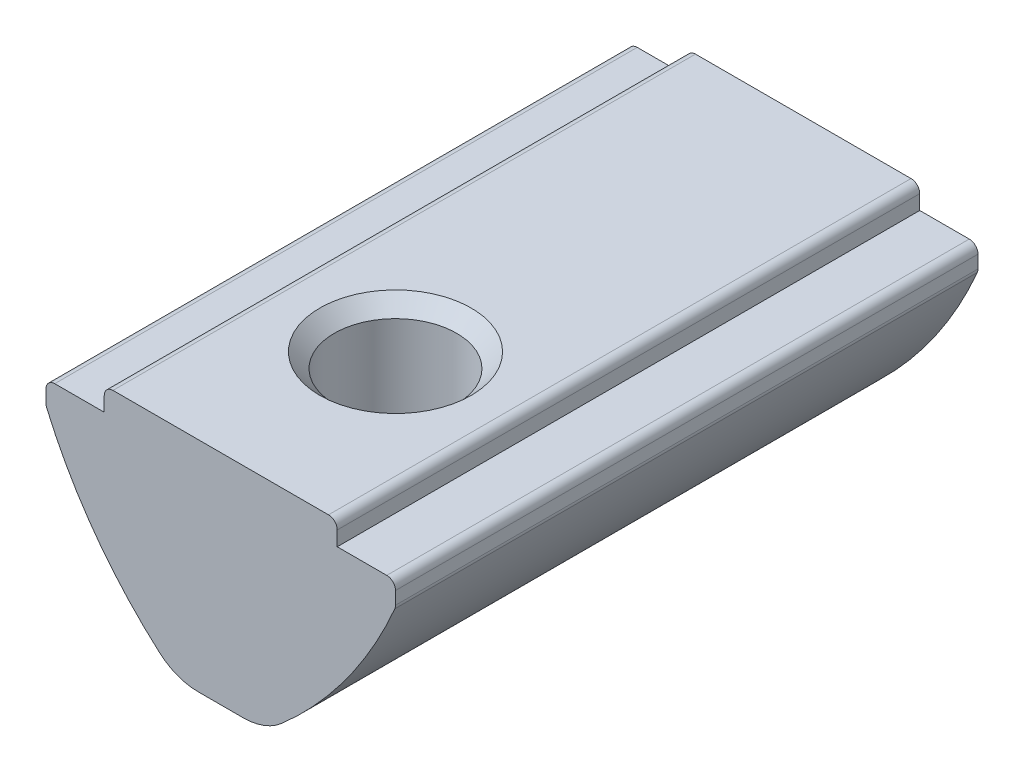
ISO-10303-21;
HEADER;
FILE_DESCRIPTION(('STEP AP214'),'2;1');
FILE_NAME('part.step','',(''),(''),'','','');
FILE_SCHEMA(('AUTOMOTIVE_DESIGN { 1 0 10303 214 1 1 1 1 }'));
ENDSEC;
DATA;
#1=APPLICATION_CONTEXT('core data for automotive mechanical design processes');
#2=APPLICATION_PROTOCOL_DEFINITION('international standard','automotive_design',2000,#1);
#3=PRODUCT_CONTEXT('',#1,'mechanical');
#4=PRODUCT('Part','Part','',(#3));
#5=PRODUCT_RELATED_PRODUCT_CATEGORY('part','',(#4));
#6=PRODUCT_DEFINITION_FORMATION('','',#4);
#7=PRODUCT_DEFINITION_CONTEXT('part definition',#1,'design');
#8=PRODUCT_DEFINITION('design','',#6,#7);
#9=PRODUCT_DEFINITION_SHAPE('','',#8);
#10=(LENGTH_UNIT() NAMED_UNIT(*) SI_UNIT(.MILLI.,.METRE.));
#11=(NAMED_UNIT(*) PLANE_ANGLE_UNIT() SI_UNIT($,.RADIAN.));
#12=(NAMED_UNIT(*) SI_UNIT($,.STERADIAN.) SOLID_ANGLE_UNIT());
#13=UNCERTAINTY_MEASURE_WITH_UNIT(LENGTH_MEASURE(1.E-05),#10,'distance_accuracy_value','');
#14=(GEOMETRIC_REPRESENTATION_CONTEXT(3) GLOBAL_UNCERTAINTY_ASSIGNED_CONTEXT((#13)) GLOBAL_UNIT_ASSIGNED_CONTEXT((#10,
#11,#12)) REPRESENTATION_CONTEXT('',''));
#15=CARTESIAN_POINT('',(0.,0.,0.));
#16=DIRECTION('',(0.,0.,1.));
#17=DIRECTION('',(1.,0.,0.));
#18=AXIS2_PLACEMENT_3D('',#15,#16,#17);
#19=CARTESIAN_POINT('',(-1.5,-7.5,10.));
#20=DIRECTION('',(0.,1.,0.));
#21=DIRECTION('',(0.,0.,1.));
#22=AXIS2_PLACEMENT_3D('',#19,#20,#21);
#23=PLANE('',#22);
#24=DIRECTION('',(0.,0.,-1.));
#25=VECTOR('',#24,1.);
#26=CARTESIAN_POINT('',(0.77644394282172,-7.5,10.));
#27=LINE('',#26,#25);
#28=CARTESIAN_POINT('',(0.77644394282172,-7.5,-10.));
#29=VERTEX_POINT('',#28);
#30=CARTESIAN_POINT('',(0.77644394282172,-7.5,-7.39897634134944));
#31=VERTEX_POINT('',#30);
#32=EDGE_CURVE('E213',#29,#31,#27,.F.);
#33=ORIENTED_EDGE('',*,*,#32,.T.);
#34=CARTESIAN_POINT('',(0.,-7.5,-6.));
#35=DIRECTION('',(0.,1.,0.));
#36=DIRECTION('',(0.,0.,1.));
#37=AXIS2_PLACEMENT_3D('',#34,#35,#36);
#38=CIRCLE('',#37,1.6);
#39=CARTESIAN_POINT('',(-0.77644394282172,-7.5,-7.39897634134944));
#40=VERTEX_POINT('',#39);
#41=EDGE_CURVE('E58',#31,#40,#38,.T.);
#42=ORIENTED_EDGE('',*,*,#41,.T.);
#43=DIRECTION('',(0.,0.,-1.));
#44=VECTOR('',#43,1.);
#45=CARTESIAN_POINT('',(-0.77644394282172,-7.5,10.));
#46=LINE('',#45,#44);
#47=CARTESIAN_POINT('',(-0.77644394282172,-7.5,-10.));
#48=VERTEX_POINT('',#47);
#49=EDGE_CURVE('E379',#40,#48,#46,.T.);
#50=ORIENTED_EDGE('',*,*,#49,.T.);
#51=DIRECTION('',(1.,0.,0.));
#52=VECTOR('',#51,1.);
#53=CARTESIAN_POINT('',(-1.5,-7.5,-10.));
#54=LINE('',#53,#52);
#55=EDGE_CURVE('E466',#48,#29,#54,.T.);
#56=ORIENTED_EDGE('',*,*,#55,.T.);
#57=EDGE_LOOP('',(#33,#42,#50,#56));
#58=FACE_BOUND('',#57,.T.);
#59=ADVANCED_FACE('F37',(#58),#23,.F.);
#60=CARTESIAN_POINT('',(-0.77644394282172,-7.5,2.04881195071939));
#61=VERTEX_POINT('',#60);
#62=CARTESIAN_POINT('',(-0.77644394282172,-7.5,-4.60102365865056));
#63=VERTEX_POINT('',#62);
#64=EDGE_CURVE('E219',#61,#63,#46,.T.);
#65=ORIENTED_EDGE('',*,*,#64,.T.);
#66=CARTESIAN_POINT('',(0.77644394282172,-7.5,-4.60102365865056));
#67=VERTEX_POINT('',#66);
#68=EDGE_CURVE('E217',#63,#67,#38,.T.);
#69=ORIENTED_EDGE('',*,*,#68,.T.);
#70=CARTESIAN_POINT('',(0.77644394282172,-7.5,2.04881195071939));
#71=VERTEX_POINT('',#70);
#72=EDGE_CURVE('E205',#67,#71,#27,.F.);
#73=ORIENTED_EDGE('',*,*,#72,.T.);
#74=CARTESIAN_POINT('',(0.,-7.5,4.));
#75=DIRECTION('',(0.,1.,0.));
#76=DIRECTION('',(0.,0.,1.));
#77=AXIS2_PLACEMENT_3D('',#74,#75,#76);
#78=CIRCLE('',#77,2.1);
#79=EDGE_CURVE('E546',#71,#61,#78,.T.);
#80=ORIENTED_EDGE('',*,*,#79,.T.);
#81=EDGE_LOOP('',(#65,#69,#73,#80));
#82=FACE_BOUND('',#81,.T.);
#83=ADVANCED_FACE('F218',(#82),#23,.F.);
#84=CARTESIAN_POINT('',(-0.77644394282172,-5.5,10.));
#85=DIRECTION('',(0.,0.,-1.));
#86=DIRECTION('',(-1.,0.,0.));
#87=AXIS2_PLACEMENT_3D('',#84,#85,#86);
#88=CYLINDRICAL_SURFACE('',#87,2.);
#89=CARTESIAN_POINT('',(-0.77624394282172,-7.49999999,-4.60091266704591));
#90=CARTESIAN_POINT('',(-0.823888907795322,-7.5000163662139,-4.62735457427018));
#91=CARTESIAN_POINT('',(-0.870798730630545,-7.49830726234882,-4.65510497142584));
#92=CARTESIAN_POINT('',(-0.962717315036726,-7.49183657407774,-4.7132735984853));
#93=CARTESIAN_POINT('',(-1.0077260427266,-7.48707493529428,-4.74369187590603));
#94=CARTESIAN_POINT('',(-1.0959110921607,-7.47482808508022,-4.80760942489962));
#95=CARTESIAN_POINT('',(-1.13906058626592,-7.4673123624851,-4.84113994080932));
#96=CARTESIAN_POINT('',(-1.22250181673807,-7.4500905430944,-4.91104627803335));
#97=CARTESIAN_POINT('',(-1.26279368231908,-7.44038454542012,-4.94742197054005));
#98=CARTESIAN_POINT('',(-1.3789243012502,-7.40877391489258,-5.06118056034471));
#99=CARTESIAN_POINT('',(-1.44982822654987,-7.38440710940906,-5.14306101347614));
#100=CARTESIAN_POINT('',(-1.57354123819966,-7.3354966378064,-5.3190032687244));
#101=CARTESIAN_POINT('',(-1.6264693454646,-7.31095527899559,-5.41297902975195));
#102=CARTESIAN_POINT('',(-1.69215248989433,-7.27826738931791,-5.5712673679177));
#103=CARTESIAN_POINT('',(-1.71247804926022,-7.2675280679395,-5.63189787925601));
#104=CARTESIAN_POINT('',(-1.74389831934218,-7.25052986041667,-5.75612482893447));
#105=CARTESIAN_POINT('',(-1.75500247468365,-7.24426639099372,-5.81971816203325));
#106=CARTESIAN_POINT('',(-1.76716152938497,-7.23739293100954,-5.94850817229138));
#107=CARTESIAN_POINT('',(-1.76816667157315,-7.23681093308248,-6.01371120296714));
#108=CARTESIAN_POINT('',(-1.75990866552184,-7.24149821482215,-6.14325746149771));
#109=CARTESIAN_POINT('',(-1.7506409738932,-7.24677008349333,-6.20760029616962));
#110=CARTESIAN_POINT('',(-1.72342839957346,-7.26165745476622,-6.32976441544547));
#111=CARTESIAN_POINT('',(-1.70603176652634,-7.27099628105936,-6.38774604111059));
#112=CARTESIAN_POINT('',(-1.66381958824499,-7.29251936403575,-6.50034639176776));
#113=CARTESIAN_POINT('',(-1.63900094313407,-7.30470480917124,-6.55496370010217));
#114=CARTESIAN_POINT('',(-1.56726801843416,-7.33763154056192,-6.68997086642714));
#115=CARTESIAN_POINT('',(-1.51576068341343,-7.35934509079095,-6.76768169791928));
#116=CARTESIAN_POINT('',(-1.4003783513937,-7.40117965250356,-6.91406327923823));
#117=CARTESIAN_POINT('',(-1.33646013382005,-7.42129474199644,-6.98270098579788));
#118=CARTESIAN_POINT('',(-1.23118790272236,-7.44798568407113,-7.08116188497315));
#119=CARTESIAN_POINT('',(-1.19321624352198,-7.45650030704662,-7.11415595694848));
#120=CARTESIAN_POINT('',(-1.11491053969296,-7.47155445418425,-7.17772357394651));
#121=CARTESIAN_POINT('',(-1.07457630166353,-7.47809381638093,-7.20829692032539));
#122=CARTESIAN_POINT('',(-0.992148835887978,-7.48876531240439,-7.26690512322127));
#123=CARTESIAN_POINT('',(-0.950066811240351,-7.49291081433173,-7.29495332368136));
#124=CARTESIAN_POINT('',(-0.864283149079416,-7.49853473621165,-7.34874151499675));
#125=CARTESIAN_POINT('',(-0.820581560156108,-7.50001323611334,-7.37448157502152));
#126=CARTESIAN_POINT('',(-0.776243942821723,-7.49999999000001,-7.39908733295409));
#127=B_SPLINE_CURVE_WITH_KNOTS('',3,(#89,#90,#91,#92,#93,#94,#95,#96,#97,#98,#99,#100,#101,#102,
#103,#104,#105,#106,#107,#108,#109,#110,#111,#112,#113,#114,#115,#116,#117,#118,#119,#120,#121,
#122,#123,#124,#125,#126),.UNSPECIFIED.,.F.,.F.,(4,2,2,2,2,2,2,2,2,2,2,2,2,2,2,2,2,2,4),(0.,
0.163411533222596,0.326825977518133,0.492108424718467,0.657383393531388,0.98862743047147,
1.31763341861502,1.51142378927634,1.70501543285838,1.899560424722,2.09419149277645,
2.27725899246955,2.4604030591533,2.74602323733678,3.03265652224181,3.18558675269292,
3.33852951956205,3.49060973202143,3.64268538547384),.UNSPECIFIED.);
#128=EDGE_CURVE('E65',#63,#40,#127,.T.);
#129=ORIENTED_EDGE('',*,*,#128,.F.);
#130=ORIENTED_EDGE('',*,*,#64,.F.);
#131=CARTESIAN_POINT('',(-2.09685806452266,-7.00216728336518,3.8851685703029));
#132=CARTESIAN_POINT('',(-2.09387785125193,-7.0047617566528,3.83053061898592));
#133=CARTESIAN_POINT('',(-2.08874619085739,-7.00928252105551,3.776141254856));
#134=CARTESIAN_POINT('',(-2.07436116921922,-7.02168336839402,3.66839752153012));
#135=CARTESIAN_POINT('',(-2.06511552704175,-7.02955715886203,3.61504140838509));
#136=CARTESIAN_POINT('',(-2.04277676932244,-7.04809659184102,3.51018945612668));
#137=CARTESIAN_POINT('',(-2.0297206188488,-7.05873530846644,3.45868084884849));
#138=CARTESIAN_POINT('',(-1.9999188839623,-7.08223610715821,3.35725602843755));
#139=CARTESIAN_POINT('',(-1.98317156703263,-7.09509923267902,3.30734057571825));
#140=CARTESIAN_POINT('',(-1.9279219405612,-7.13590257396027,3.16098976917319));
#141=CARTESIAN_POINT('',(-1.88423278916624,-7.16621984543787,3.06712998567318));
#142=CARTESIAN_POINT('',(-1.7837734563049,-7.2288168867869,2.8869642278417));
#143=CARTESIAN_POINT('',(-1.72694828868573,-7.2611044739321,2.80069217144384));
#144=CARTESIAN_POINT('',(-1.58969471615555,-7.32906594628692,2.62244736387126));
#145=CARTESIAN_POINT('',(-1.50687299957372,-7.3643370965982,2.53213927269635));
#146=CARTESIAN_POINT('',(-1.32511229551078,-7.42563788840849,2.36627075833631));
#147=CARTESIAN_POINT('',(-1.22625428288873,-7.45171197257913,2.29064023030908));
#148=CARTESIAN_POINT('',(-1.06648713202169,-7.47961855873369,2.18983502501215));
#149=CARTESIAN_POINT('',(-1.01064985125347,-7.48707055058,2.15806821441949));
#150=CARTESIAN_POINT('',(-0.895769640882038,-7.49727576063716,2.09953083427684));
#151=CARTESIAN_POINT('',(-0.836716197573826,-7.50001247907979,2.0727780998245));
#152=CARTESIAN_POINT('',(-0.77644394282172,-7.5,2.04881195071939));
#153=B_SPLINE_CURVE_WITH_KNOTS('',3,(#131,#132,#133,#134,#135,#136,#137,#138,#139,#140,#141,
#142,#143,#144,#145,#146,#147,#148,#149,#150,#151,#152),.UNSPECIFIED.,.F.,.F.,(4,2,2,2,2,2,2,2,
2,2,4),(0.,0.164208555238435,0.328110296625649,0.490472100454462,0.6529102746881,
0.975251090334896,1.29896644289256,1.67959816901834,2.05836453702208,2.25197975328078,
2.44627110568828),.UNSPECIFIED.);
#154=CARTESIAN_POINT('',(-2.09685806452266,-7.00216728336519,3.88516857030283));
#155=VERTEX_POINT('',#154);
#156=EDGE_CURVE('E285',#155,#61,#153,.T.);
#157=ORIENTED_EDGE('',*,*,#156,.F.);
#158=DIRECTION('',(0.,0.,-1.));
#159=VECTOR('',#158,1.);
#160=CARTESIAN_POINT('',(-2.09685806452266,-7.00216728336518,10.));
#161=LINE('',#160,#159);
#162=CARTESIAN_POINT('',(-2.09685806452266,-7.00216728336518,-10.));
#163=VERTEX_POINT('',#162);
#164=EDGE_CURVE('E543',#163,#155,#161,.F.);
#165=ORIENTED_EDGE('',*,*,#164,.F.);
#166=CARTESIAN_POINT('',(-0.77644394282172,-5.5,-10.));
#167=DIRECTION('',(0.,0.,1.));
#168=DIRECTION('',(1.,0.,0.));
#169=AXIS2_PLACEMENT_3D('',#166,#167,#168);
#170=CIRCLE('',#169,2.);
#171=EDGE_CURVE('E384',#48,#163,#170,.F.);
#172=ORIENTED_EDGE('',*,*,#171,.F.);
#173=ORIENTED_EDGE('',*,*,#49,.F.);
#174=EDGE_LOOP('',(#129,#130,#157,#165,#172,#173));
#175=FACE_BOUND('',#174,.T.);
#176=ADVANCED_FACE('F352',(#175),#88,.T.);
#177=CARTESIAN_POINT('',(0.77644394282172,-5.5,10.));
#178=DIRECTION('',(0.,0.,-1.));
#179=DIRECTION('',(-1.,0.,0.));
#180=AXIS2_PLACEMENT_3D('',#177,#178,#179);
#181=CYLINDRICAL_SURFACE('',#180,2.);
#182=CARTESIAN_POINT('',(0.77624394282172,-7.49999999,-7.39908733295409));
#183=CARTESIAN_POINT('',(0.823888907795322,-7.5000163662139,-7.37264542572982));
#184=CARTESIAN_POINT('',(0.870798730630545,-7.49830726234882,-7.34489502857416));
#185=CARTESIAN_POINT('',(0.962717315036726,-7.49183657407774,-7.2867264015147));
#186=CARTESIAN_POINT('',(1.0077260427266,-7.48707493529428,-7.25630812409397));
#187=CARTESIAN_POINT('',(1.0959110921607,-7.47482808508022,-7.19239057510038));
#188=CARTESIAN_POINT('',(1.13906058626592,-7.4673123624851,-7.15886005919068));
#189=CARTESIAN_POINT('',(1.22250181673807,-7.4500905430944,-7.08895372196665));
#190=CARTESIAN_POINT('',(1.26279368231908,-7.44038454542012,-7.05257802945995));
#191=CARTESIAN_POINT('',(1.37892430125021,-7.40877391489258,-6.93881943965529));
#192=CARTESIAN_POINT('',(1.44982822654987,-7.38440710940906,-6.85693898652386));
#193=CARTESIAN_POINT('',(1.57354123819966,-7.3354966378064,-6.68099673127559));
#194=CARTESIAN_POINT('',(1.6264693454646,-7.31095527899559,-6.58702097024805));
#195=CARTESIAN_POINT('',(1.69215248989433,-7.27826738931791,-6.4287326320823));
#196=CARTESIAN_POINT('',(1.71247804926022,-7.2675280679395,-6.36810212074399));
#197=CARTESIAN_POINT('',(1.74389831934219,-7.25052986041667,-6.24387517106553));
#198=CARTESIAN_POINT('',(1.75500247468365,-7.24426639099372,-6.18028183796674));
#199=CARTESIAN_POINT('',(1.76716152938497,-7.23739293100954,-6.05149182770862));
#200=CARTESIAN_POINT('',(1.76816667157315,-7.23681093308248,-5.98628879703286));
#201=CARTESIAN_POINT('',(1.75990866552184,-7.24149821482215,-5.85674253850229));
#202=CARTESIAN_POINT('',(1.7506409738932,-7.24677008349333,-5.79239970383038));
#203=CARTESIAN_POINT('',(1.72342839957346,-7.26165745476622,-5.67023558455453));
#204=CARTESIAN_POINT('',(1.70603176652634,-7.27099628105936,-5.61225395888941));
#205=CARTESIAN_POINT('',(1.66381958824499,-7.29251936403575,-5.49965360823224));
#206=CARTESIAN_POINT('',(1.63900094313407,-7.30470480917124,-5.44503629989783));
#207=CARTESIAN_POINT('',(1.56726801843416,-7.33763154056192,-5.31002913357287));
#208=CARTESIAN_POINT('',(1.51576068341344,-7.35934509079095,-5.23231830208072));
#209=CARTESIAN_POINT('',(1.4003783513937,-7.40117965250356,-5.08593672076177));
#210=CARTESIAN_POINT('',(1.33646013382005,-7.42129474199644,-5.01729901420212));
#211=CARTESIAN_POINT('',(1.23118790272236,-7.44798568407113,-4.91883811502684));
#212=CARTESIAN_POINT('',(1.19321624352198,-7.45650030704662,-4.88584404305152));
#213=CARTESIAN_POINT('',(1.11491053969296,-7.47155445418425,-4.82227642605349));
#214=CARTESIAN_POINT('',(1.07457630166353,-7.47809381638093,-4.79170307967461));
#215=CARTESIAN_POINT('',(0.992148835887978,-7.48876531240439,-4.73309487677873));
#216=CARTESIAN_POINT('',(0.950066811240351,-7.49291081433173,-4.70504667631864));
#217=CARTESIAN_POINT('',(0.864283149079416,-7.49853473621165,-4.65125848500325));
#218=CARTESIAN_POINT('',(0.820581560156109,-7.50001323611334,-4.62551842497848));
#219=CARTESIAN_POINT('',(0.776243942821723,-7.49999999000001,-4.60091266704591));
#220=B_SPLINE_CURVE_WITH_KNOTS('',3,(#182,#183,#184,#185,#186,#187,#188,#189,#190,#191,#192,
#193,#194,#195,#196,#197,#198,#199,#200,#201,#202,#203,#204,#205,#206,#207,#208,#209,#210,#211,
#212,#213,#214,#215,#216,#217,#218,#219),.UNSPECIFIED.,.F.,.F.,(4,2,2,2,2,2,2,2,2,2,2,2,2,2,2,2,
2,2,4),(0.,0.163411533222596,0.326825977518133,0.492108424718467,0.657383393531388,
0.988627430471472,1.31763341861502,1.51142378927634,1.70501543285838,1.899560424722,
2.09419149277645,2.27725899246955,2.4604030591533,2.74602323733678,3.03265652224181,
3.18558675269292,3.33852951956205,3.49060973202143,3.64268538547384),.UNSPECIFIED.);
#221=EDGE_CURVE('E11',#31,#67,#220,.T.);
#222=ORIENTED_EDGE('',*,*,#221,.F.);
#223=ORIENTED_EDGE('',*,*,#32,.F.);
#224=CARTESIAN_POINT('',(0.77644394282172,-5.5,-10.));
#225=DIRECTION('',(0.,0.,1.));
#226=DIRECTION('',(1.,0.,0.));
#227=AXIS2_PLACEMENT_3D('',#224,#225,#226);
#228=CIRCLE('',#227,2.);
#229=CARTESIAN_POINT('',(2.09685806452266,-7.00216728336518,-10.));
#230=VERTEX_POINT('',#229);
#231=EDGE_CURVE('E381',#230,#29,#228,.F.);
#232=ORIENTED_EDGE('',*,*,#231,.F.);
#233=DIRECTION('',(0.,0.,-1.));
#234=VECTOR('',#233,1.);
#235=CARTESIAN_POINT('',(2.09685806452266,-7.00216728336518,10.));
#236=LINE('',#235,#234);
#237=CARTESIAN_POINT('',(2.09685806452266,-7.00216728336518,3.88516857030293));
#238=VERTEX_POINT('',#237);
#239=EDGE_CURVE('E394',#238,#230,#236,.T.);
#240=ORIENTED_EDGE('',*,*,#239,.F.);
#241=CARTESIAN_POINT('',(0.77644394282172,-7.5,2.04881195071939));
#242=CARTESIAN_POINT('',(0.825489025833142,-7.50000912965631,2.06831553729218));
#243=CARTESIAN_POINT('',(0.87376034850417,-7.49819665810218,2.08967843809681));
#244=CARTESIAN_POINT('',(0.96831454275891,-7.49133601026457,2.13583349847796));
#245=CARTESIAN_POINT('',(1.01460018254455,-7.48629250579024,2.16062066632179));
#246=CARTESIAN_POINT('',(1.10444266094516,-7.47343838150448,2.21313367075635));
#247=CARTESIAN_POINT('',(1.14802182380417,-7.46565540671627,2.24082827655143));
#248=CARTESIAN_POINT('',(1.23270595788241,-7.44774223575493,2.29909437881921));
#249=CARTESIAN_POINT('',(1.27381007382,-7.43761123399131,2.32966686052688));
#250=CARTESIAN_POINT('',(1.39266458125385,-7.40446880351689,2.42496115741932));
#251=CARTESIAN_POINT('',(1.46653677083534,-7.37861461648829,2.49360223215167));
#252=CARTESIAN_POINT('',(1.60324545892267,-7.32260568963185,2.63996489475107));
#253=CARTESIAN_POINT('',(1.66603549537508,-7.29243376130317,2.71772253978925));
#254=CARTESIAN_POINT('',(1.78908608782947,-7.22631756640321,2.89430862210989));
#255=CARTESIAN_POINT('',(1.84730462525603,-7.19022728843123,2.99451264014934));
#256=CARTESIAN_POINT('',(1.94679085394169,-7.12292657105875,3.20414344190052));
#257=CARTESIAN_POINT('',(1.98812654481142,-7.0916968757696,3.31353104489529));
#258=CARTESIAN_POINT('',(2.04113453272491,-7.04960468831407,3.50039429415139));
#259=CARTESIAN_POINT('',(2.05812589646692,-7.03544039961475,3.57560706885912));
#260=CARTESIAN_POINT('',(2.0774098347061,-7.01906489668942,3.69034695983945));
#261=CARTESIAN_POINT('',(2.08281000275543,-7.01441237581197,3.72901942054124));
#262=CARTESIAN_POINT('',(2.09146182533204,-7.00690293810222,3.80680958691093));
#263=CARTESIAN_POINT('',(2.09471162299705,-7.00404757323228,3.84592764779044));
#264=CARTESIAN_POINT('',(2.09685806452266,-7.00216728336518,3.88516857030293));
#265=B_SPLINE_CURVE_WITH_KNOTS('',3,(#241,#242,#243,#244,#245,#246,#247,#248,#249,#250,#251,
#252,#253,#254,#255,#256,#257,#258,#259,#260,#261,#262,#263,#264),.UNSPECIFIED.,.F.,.F.,(4,2,2,
2,2,2,2,2,2,2,2,4),(0.,0.158226219745636,0.316224172114115,0.472671378764314,0.629172340948554,
0.940159871309358,1.2524217540654,1.61505643482998,1.97621576354275,2.21071039173396,
2.32858804799797,2.44656736020053),.UNSPECIFIED.);
#266=EDGE_CURVE('E51',#71,#238,#265,.T.);
#267=ORIENTED_EDGE('',*,*,#266,.F.);
#268=ORIENTED_EDGE('',*,*,#72,.F.);
#269=EDGE_LOOP('',(#222,#223,#232,#240,#267,#268));
#270=FACE_BOUND('',#269,.T.);
#271=ADVANCED_FACE('F207',(#270),#181,.T.);
#272=CARTESIAN_POINT('',(4.,0.,10.));
#273=DIRECTION('',(-1.,0.,0.));
#274=DIRECTION('',(0.,0.,1.));
#275=AXIS2_PLACEMENT_3D('',#272,#273,#274);
#276=PLANE('',#275);
#277=DIRECTION('',(0.,1.,0.));
#278=VECTOR('',#277,1.);
#279=CARTESIAN_POINT('',(4.,0.,-10.));
#280=LINE('',#279,#278);
#281=CARTESIAN_POINT('',(4.,-0.799999999999998,-10.));
#282=VERTEX_POINT('',#281);
#283=CARTESIAN_POINT('',(4.,-0.3,-10.));
#284=VERTEX_POINT('',#283);
#285=EDGE_CURVE('E482',#282,#284,#280,.T.);
#286=ORIENTED_EDGE('',*,*,#285,.T.);
#287=DIRECTION('',(0.,0.,-1.));
#288=VECTOR('',#287,1.);
#289=CARTESIAN_POINT('',(4.,-0.3,10.));
#290=LINE('',#289,#288);
#291=CARTESIAN_POINT('',(4.,-0.3,10.));
#292=VERTEX_POINT('',#291);
#293=EDGE_CURVE('E431',#284,#292,#290,.F.);
#294=ORIENTED_EDGE('',*,*,#293,.T.);
#295=DIRECTION('',(0.,1.,0.));
#296=VECTOR('',#295,1.);
#297=CARTESIAN_POINT('',(4.,0.,10.));
#298=LINE('',#297,#296);
#299=CARTESIAN_POINT('',(4.,-0.799999999999998,10.));
#300=VERTEX_POINT('',#299);
#301=EDGE_CURVE('E460',#300,#292,#298,.T.);
#302=ORIENTED_EDGE('',*,*,#301,.F.);
#303=DIRECTION('',(0.,0.,-1.));
#304=VECTOR('',#303,1.);
#305=CARTESIAN_POINT('',(4.,-0.799999999999998,10.));
#306=LINE('',#305,#304);
#307=EDGE_CURVE('E454',#300,#282,#306,.T.);
#308=ORIENTED_EDGE('',*,*,#307,.T.);
#309=EDGE_LOOP('',(#286,#294,#302,#308));
#310=FACE_BOUND('',#309,.T.);
#311=ADVANCED_FACE('F313',(#310),#276,.F.);
#312=CARTESIAN_POINT('',(-4.,0.,10.));
#313=DIRECTION('',(0.,-1.,0.));
#314=DIRECTION('',(0.,0.,-1.));
#315=AXIS2_PLACEMENT_3D('',#312,#313,#314);
#316=PLANE('',#315);
#317=CARTESIAN_POINT('',(0.,0.,4.));
#318=DIRECTION('',(0.,1.,0.));
#319=DIRECTION('',(0.,0.,1.));
#320=AXIS2_PLACEMENT_3D('',#317,#318,#319);
#321=CIRCLE('',#320,2.6);
#322=CARTESIAN_POINT('',(0.,0.,6.6));
#323=VERTEX_POINT('',#322);
#324=EDGE_CURVE('E223',#323,#323,#321,.T.);
#325=ORIENTED_EDGE('',*,*,#324,.F.);
#326=EDGE_LOOP('',(#325));
#327=FACE_BOUND('',#326,.T.);
#328=DIRECTION('',(-1.,0.,0.));
#329=VECTOR('',#328,1.);
#330=CARTESIAN_POINT('',(-4.,0.,10.));
#331=LINE('',#330,#329);
#332=CARTESIAN_POINT('',(3.7,0.,10.));
#333=VERTEX_POINT('',#332);
#334=CARTESIAN_POINT('',(-3.7,0.,10.));
#335=VERTEX_POINT('',#334);
#336=EDGE_CURVE('E503',#333,#335,#331,.T.);
#337=ORIENTED_EDGE('',*,*,#336,.F.);
#338=DIRECTION('',(0.,0.,-1.));
#339=VECTOR('',#338,1.);
#340=CARTESIAN_POINT('',(3.7,0.,10.));
#341=LINE('',#340,#339);
#342=CARTESIAN_POINT('',(3.7,0.,-10.));
#343=VERTEX_POINT('',#342);
#344=EDGE_CURVE('E446',#333,#343,#341,.T.);
#345=ORIENTED_EDGE('',*,*,#344,.T.);
#346=DIRECTION('',(-1.,0.,0.));
#347=VECTOR('',#346,1.);
#348=CARTESIAN_POINT('',(-4.,0.,-10.));
#349=LINE('',#348,#347);
#350=CARTESIAN_POINT('',(-3.7,0.,-10.));
#351=VERTEX_POINT('',#350);
#352=EDGE_CURVE('E479',#343,#351,#349,.T.);
#353=ORIENTED_EDGE('',*,*,#352,.T.);
#354=DIRECTION('',(0.,0.,-1.));
#355=VECTOR('',#354,1.);
#356=CARTESIAN_POINT('',(-3.7,0.,10.));
#357=LINE('',#356,#355);
#358=EDGE_CURVE('E449',#351,#335,#357,.F.);
#359=ORIENTED_EDGE('',*,*,#358,.T.);
#360=EDGE_LOOP('',(#337,#345,#353,#359));
#361=FACE_BOUND('',#360,.T.);
#362=ADVANCED_FACE('F309',(#327,#361),#316,.F.);
#363=CARTESIAN_POINT('',(-4.,0.,10.));
#364=DIRECTION('',(1.,0.,0.));
#365=DIRECTION('',(0.,0.,-1.));
#366=AXIS2_PLACEMENT_3D('',#363,#364,#365);
#367=PLANE('',#366);
#368=DIRECTION('',(0.,-1.,0.));
#369=VECTOR('',#368,1.);
#370=CARTESIAN_POINT('',(-4.,0.,10.));
#371=LINE('',#370,#369);
#372=CARTESIAN_POINT('',(-4.,-0.3,10.));
#373=VERTEX_POINT('',#372);
#374=CARTESIAN_POINT('',(-4.,-0.8,10.));
#375=VERTEX_POINT('',#374);
#376=EDGE_CURVE('E501',#373,#375,#371,.T.);
#377=ORIENTED_EDGE('',*,*,#376,.F.);
#378=DIRECTION('',(0.,0.,-1.));
#379=VECTOR('',#378,1.);
#380=CARTESIAN_POINT('',(-4.,-0.3,10.));
#381=LINE('',#380,#379);
#382=CARTESIAN_POINT('',(-4.,-0.3,-10.));
#383=VERTEX_POINT('',#382);
#384=EDGE_CURVE('E416',#373,#383,#381,.T.);
#385=ORIENTED_EDGE('',*,*,#384,.T.);
#386=DIRECTION('',(0.,-1.,0.));
#387=VECTOR('',#386,1.);
#388=CARTESIAN_POINT('',(-4.,0.,-10.));
#389=LINE('',#388,#387);
#390=CARTESIAN_POINT('',(-4.,-0.8,-10.));
#391=VERTEX_POINT('',#390);
#392=EDGE_CURVE('E477',#383,#391,#389,.T.);
#393=ORIENTED_EDGE('',*,*,#392,.T.);
#394=DIRECTION('',(0.,0.,-1.));
#395=VECTOR('',#394,1.);
#396=CARTESIAN_POINT('',(-4.,-0.8,10.));
#397=LINE('',#396,#395);
#398=EDGE_CURVE('E451',#375,#391,#397,.T.);
#399=ORIENTED_EDGE('',*,*,#398,.F.);
#400=EDGE_LOOP('',(#377,#385,#393,#399));
#401=FACE_BOUND('',#400,.T.);
#402=ADVANCED_FACE('F305',(#401),#367,.F.);
#403=CARTESIAN_POINT('',(-4.,-0.8,10.));
#404=DIRECTION('',(0.,-1.,0.));
#405=DIRECTION('',(1.,0.,0.));
#406=AXIS2_PLACEMENT_3D('',#403,#404,#405);
#407=PLANE('',#406);
#408=DIRECTION('',(-1.,0.,0.));
#409=VECTOR('',#408,1.);
#410=CARTESIAN_POINT('',(-4.,-0.8,-10.));
#411=LINE('',#410,#409);
#412=CARTESIAN_POINT('',(-5.7,-0.8,-10.));
#413=VERTEX_POINT('',#412);
#414=EDGE_CURVE('E474',#391,#413,#411,.T.);
#415=ORIENTED_EDGE('',*,*,#414,.T.);
#416=DIRECTION('',(0.,0.,-1.));
#417=VECTOR('',#416,1.);
#418=CARTESIAN_POINT('',(-5.7,-0.8,10.));
#419=LINE('',#418,#417);
#420=CARTESIAN_POINT('',(-5.7,-0.8,10.));
#421=VERTEX_POINT('',#420);
#422=EDGE_CURVE('E398',#413,#421,#419,.F.);
#423=ORIENTED_EDGE('',*,*,#422,.T.);
#424=DIRECTION('',(-1.,0.,0.));
#425=VECTOR('',#424,1.);
#426=CARTESIAN_POINT('',(-4.,-0.8,10.));
#427=LINE('',#426,#425);
#428=EDGE_CURVE('E498',#375,#421,#427,.T.);
#429=ORIENTED_EDGE('',*,*,#428,.F.);
#430=ORIENTED_EDGE('',*,*,#398,.T.);
#431=EDGE_LOOP('',(#415,#423,#429,#430));
#432=FACE_BOUND('',#431,.T.);
#433=ADVANCED_FACE('F301',(#432),#407,.F.);
#434=CARTESIAN_POINT('',(-6.,-0.8,10.));
#435=DIRECTION('',(1.,0.,0.));
#436=DIRECTION('',(0.,1.,0.));
#437=AXIS2_PLACEMENT_3D('',#434,#435,#436);
#438=PLANE('',#437);
#439=DIRECTION('',(0.,-1.,0.));
#440=VECTOR('',#439,1.);
#441=CARTESIAN_POINT('',(-6.,-0.8,10.));
#442=LINE('',#441,#440);
#443=CARTESIAN_POINT('',(-6.,-1.1,10.));
#444=VERTEX_POINT('',#443);
#445=CARTESIAN_POINT('',(-6.,-1.53860764081011,10.));
#446=VERTEX_POINT('',#445);
#447=EDGE_CURVE('E495',#444,#446,#442,.T.);
#448=ORIENTED_EDGE('',*,*,#447,.F.);
#449=DIRECTION('',(0.,0.,-1.));
#450=VECTOR('',#449,1.);
#451=CARTESIAN_POINT('',(-6.,-1.1,10.));
#452=LINE('',#451,#450);
#453=CARTESIAN_POINT('',(-6.,-1.1,-10.));
#454=VERTEX_POINT('',#453);
#455=EDGE_CURVE('E400',#444,#454,#452,.T.);
#456=ORIENTED_EDGE('',*,*,#455,.T.);
#457=DIRECTION('',(0.,-1.,0.));
#458=VECTOR('',#457,1.);
#459=CARTESIAN_POINT('',(-6.,-0.8,-10.));
#460=LINE('',#459,#458);
#461=CARTESIAN_POINT('',(-6.,-1.53860764081011,-10.));
#462=VERTEX_POINT('',#461);
#463=EDGE_CURVE('E471',#454,#462,#460,.T.);
#464=ORIENTED_EDGE('',*,*,#463,.T.);
#465=DIRECTION('',(0.,0.,-1.));
#466=VECTOR('',#465,1.);
#467=CARTESIAN_POINT('',(-6.,-1.53860764081011,10.));
#468=LINE('',#467,#466);
#469=EDGE_CURVE('E403',#462,#446,#468,.F.);
#470=ORIENTED_EDGE('',*,*,#469,.T.);
#471=EDGE_LOOP('',(#448,#456,#464,#470));
#472=FACE_BOUND('',#471,.T.);
#473=ADVANCED_FACE('F297',(#472),#438,.F.);
#474=CARTESIAN_POINT('',(7.80624784823439,4.26408734187369,10.));
#475=DIRECTION('',(0.,0.,-1.));
#476=DIRECTION('',(-1.,0.,0.));
#477=AXIS2_PLACEMENT_3D('',#474,#475,#476);
#478=CYLINDRICAL_SURFACE('',#477,15.);
#479=ORIENTED_EDGE('',*,*,#164,.T.);
#480=CARTESIAN_POINT('',(-2.09685806452266,-7.00216728336519,3.88516857030283));
#481=CARTESIAN_POINT('',(-2.09895268817422,-7.00032557864145,3.92344571353522));
#482=CARTESIAN_POINT('',(-2.1,-6.99940472627959,3.96172285676761));
#483=CARTESIAN_POINT('',(-2.1,-6.99940472627959,4.03827714323239));
#484=CARTESIAN_POINT('',(-2.09895268817422,-7.00032557864145,4.07655428646478));
#485=CARTESIAN_POINT('',(-2.09685806452266,-7.00216728336519,4.11483142969717));
#486=B_SPLINE_CURVE_WITH_KNOTS('',3,(#480,#481,#482,#483,#484,#485),.UNSPECIFIED.,.F.,.F.,(4,2,
4),(0.,0.114907618226516,0.229815236453032),.UNSPECIFIED.);
#487=CARTESIAN_POINT('',(-2.09685806452266,-7.00216728336518,4.1148314296971));
#488=VERTEX_POINT('',#487);
#489=EDGE_CURVE('E278',#155,#488,#486,.T.);
#490=ORIENTED_EDGE('',*,*,#489,.T.);
#491=CARTESIAN_POINT('',(-2.09685806452266,-7.00216728336518,10.));
#492=VERTEX_POINT('',#491);
#493=EDGE_CURVE('E538',#488,#492,#161,.F.);
#494=ORIENTED_EDGE('',*,*,#493,.T.);
#495=CARTESIAN_POINT('',(7.80624784823439,4.26408734187369,10.));
#496=DIRECTION('',(0.,0.,1.));
#497=DIRECTION('',(1.,0.,0.));
#498=AXIS2_PLACEMENT_3D('',#495,#496,#497);
#499=CIRCLE('',#498,15.);
#500=CARTESIAN_POINT('',(-5.97563771118846,-1.6570299873955,10.));
#501=VERTEX_POINT('',#500);
#502=EDGE_CURVE('E492',#501,#492,#499,.T.);
#503=ORIENTED_EDGE('',*,*,#502,.F.);
#504=DIRECTION('',(0.,0.,-1.));
#505=VECTOR('',#504,1.);
#506=CARTESIAN_POINT('',(-5.97563771118846,-1.6570299873955,10.));
#507=LINE('',#506,#505);
#508=CARTESIAN_POINT('',(-5.97563771118846,-1.6570299873955,-10.));
#509=VERTEX_POINT('',#508);
#510=EDGE_CURVE('E395',#501,#509,#507,.T.);
#511=ORIENTED_EDGE('',*,*,#510,.T.);
#512=CARTESIAN_POINT('',(7.80624784823439,4.26408734187369,-10.));
#513=DIRECTION('',(0.,0.,1.));
#514=DIRECTION('',(1.,0.,0.));
#515=AXIS2_PLACEMENT_3D('',#512,#513,#514);
#516=CIRCLE('',#515,15.);
#517=EDGE_CURVE('E468',#509,#163,#516,.T.);
#518=ORIENTED_EDGE('',*,*,#517,.T.);
#519=EDGE_LOOP('',(#479,#490,#494,#503,#511,#518));
#520=FACE_BOUND('',#519,.T.);
#521=ADVANCED_FACE('F291',(#520),#478,.T.);
#522=CARTESIAN_POINT('',(-0.77644394282172,-7.5,10.));
#523=VERTEX_POINT('',#522);
#524=CARTESIAN_POINT('',(-0.77644394282172,-7.5,5.95118804928061));
#525=VERTEX_POINT('',#524);
#526=EDGE_CURVE('E371',#523,#525,#46,.T.);
#527=ORIENTED_EDGE('',*,*,#526,.T.);
#528=CARTESIAN_POINT('',(0.77644394282172,-7.5,5.95118804928061));
#529=VERTEX_POINT('',#528);
#530=EDGE_CURVE('E372',#525,#529,#78,.T.);
#531=ORIENTED_EDGE('',*,*,#530,.T.);
#532=CARTESIAN_POINT('',(0.77644394282172,-7.5,10.));
#533=VERTEX_POINT('',#532);
#534=EDGE_CURVE('E214',#529,#533,#27,.F.);
#535=ORIENTED_EDGE('',*,*,#534,.T.);
#536=DIRECTION('',(1.,0.,0.));
#537=VECTOR('',#536,1.);
#538=CARTESIAN_POINT('',(-1.5,-7.5,10.));
#539=LINE('',#538,#537);
#540=EDGE_CURVE('E375',#523,#533,#539,.T.);
#541=ORIENTED_EDGE('',*,*,#540,.F.);
#542=EDGE_LOOP('',(#527,#531,#535,#541));
#543=FACE_BOUND('',#542,.T.);
#544=ADVANCED_FACE('F296',(#543),#23,.F.);
#545=CARTESIAN_POINT('',(-7.80624784823439,4.26408734187369,10.));
#546=DIRECTION('',(0.,0.,-1.));
#547=DIRECTION('',(-1.,0.,0.));
#548=AXIS2_PLACEMENT_3D('',#545,#546,#547);
#549=CYLINDRICAL_SURFACE('',#548,15.);
#550=CARTESIAN_POINT('',(2.09685806452266,-7.00216728336518,10.));
#551=VERTEX_POINT('',#550);
#552=CARTESIAN_POINT('',(2.09685806452266,-7.00216728336518,4.11483142969705));
#553=VERTEX_POINT('',#552);
#554=EDGE_CURVE('E389',#551,#553,#236,.T.);
#555=ORIENTED_EDGE('',*,*,#554,.T.);
#556=CARTESIAN_POINT('',(2.09685806452266,-7.00216728336518,4.11483142969707));
#557=CARTESIAN_POINT('',(2.09895268817422,-7.00032557864145,4.07655428646471));
#558=CARTESIAN_POINT('',(2.1,-6.99940472627958,4.03827714323236));
#559=CARTESIAN_POINT('',(2.1,-6.99940472627958,3.96172285676764));
#560=CARTESIAN_POINT('',(2.09895268817422,-7.00032557864145,3.92344571353528));
#561=CARTESIAN_POINT('',(2.09685806452266,-7.00216728336518,3.88516857030293));
#562=B_SPLINE_CURVE_WITH_KNOTS('',3,(#556,#557,#558,#559,#560,#561),.UNSPECIFIED.,.F.,.F.,(4,2,
4),(0.,0.11490761822642,0.22981523645284),.UNSPECIFIED.);
#563=EDGE_CURVE('E264',#553,#238,#562,.T.);
#564=ORIENTED_EDGE('',*,*,#563,.T.);
#565=ORIENTED_EDGE('',*,*,#239,.T.);
#566=CARTESIAN_POINT('',(-7.80624784823439,4.26408734187369,-10.));
#567=DIRECTION('',(0.,0.,1.));
#568=DIRECTION('',(1.,0.,0.));
#569=AXIS2_PLACEMENT_3D('',#566,#567,#568);
#570=CIRCLE('',#569,15.);
#571=CARTESIAN_POINT('',(5.97563771118846,-1.6570299873955,-10.));
#572=VERTEX_POINT('',#571);
#573=EDGE_CURVE('E464',#230,#572,#570,.T.);
#574=ORIENTED_EDGE('',*,*,#573,.T.);
#575=DIRECTION('',(0.,0.,-1.));
#576=VECTOR('',#575,1.);
#577=CARTESIAN_POINT('',(5.97563771118846,-1.6570299873955,10.));
#578=LINE('',#577,#576);
#579=CARTESIAN_POINT('',(5.97563771118846,-1.6570299873955,10.));
#580=VERTEX_POINT('',#579);
#581=EDGE_CURVE('E408',#572,#580,#578,.F.);
#582=ORIENTED_EDGE('',*,*,#581,.T.);
#583=CARTESIAN_POINT('',(-7.80624784823439,4.26408734187369,10.));
#584=DIRECTION('',(0.,0.,1.));
#585=DIRECTION('',(1.,0.,0.));
#586=AXIS2_PLACEMENT_3D('',#583,#584,#585);
#587=CIRCLE('',#586,15.);
#588=EDGE_CURVE('E489',#551,#580,#587,.T.);
#589=ORIENTED_EDGE('',*,*,#588,.F.);
#590=EDGE_LOOP('',(#555,#564,#565,#574,#582,#589));
#591=FACE_BOUND('',#590,.T.);
#592=ADVANCED_FACE('F360',(#591),#549,.T.);
#593=CARTESIAN_POINT('',(6.,-0.799999999999998,10.));
#594=DIRECTION('',(-1.,0.,0.));
#595=DIRECTION('',(0.,-1.,0.));
#596=AXIS2_PLACEMENT_3D('',#593,#594,#595);
#597=PLANE('',#596);
#598=DIRECTION('',(0.,1.,0.));
#599=VECTOR('',#598,1.);
#600=CARTESIAN_POINT('',(6.,-0.799999999999998,10.));
#601=LINE('',#600,#599);
#602=CARTESIAN_POINT('',(6.,-1.53860764081011,10.));
#603=VERTEX_POINT('',#602);
#604=CARTESIAN_POINT('',(6.,-1.1,10.));
#605=VERTEX_POINT('',#604);
#606=EDGE_CURVE('E486',#603,#605,#601,.T.);
#607=ORIENTED_EDGE('',*,*,#606,.F.);
#608=DIRECTION('',(0.,0.,-1.));
#609=VECTOR('',#608,1.);
#610=CARTESIAN_POINT('',(6.,-1.53860764081011,10.));
#611=LINE('',#610,#609);
#612=CARTESIAN_POINT('',(6.,-1.53860764081011,-10.));
#613=VERTEX_POINT('',#612);
#614=EDGE_CURVE('E411',#603,#613,#611,.T.);
#615=ORIENTED_EDGE('',*,*,#614,.T.);
#616=DIRECTION('',(0.,1.,0.));
#617=VECTOR('',#616,1.);
#618=CARTESIAN_POINT('',(6.,-0.799999999999998,-10.));
#619=LINE('',#618,#617);
#620=CARTESIAN_POINT('',(6.,-1.1,-10.));
#621=VERTEX_POINT('',#620);
#622=EDGE_CURVE('E461',#613,#621,#619,.T.);
#623=ORIENTED_EDGE('',*,*,#622,.T.);
#624=DIRECTION('',(0.,0.,-1.));
#625=VECTOR('',#624,1.);
#626=CARTESIAN_POINT('',(6.,-1.1,10.));
#627=LINE('',#626,#625);
#628=EDGE_CURVE('E414',#621,#605,#627,.F.);
#629=ORIENTED_EDGE('',*,*,#628,.T.);
#630=EDGE_LOOP('',(#607,#615,#623,#629));
#631=FACE_BOUND('',#630,.T.);
#632=ADVANCED_FACE('F365',(#631),#597,.F.);
#633=CARTESIAN_POINT('',(4.,-0.799999999999998,10.));
#634=DIRECTION('',(0.,-1.,0.));
#635=DIRECTION('',(1.,0.,0.));
#636=AXIS2_PLACEMENT_3D('',#633,#634,#635);
#637=PLANE('',#636);
#638=DIRECTION('',(-1.,0.,0.));
#639=VECTOR('',#638,1.);
#640=CARTESIAN_POINT('',(4.,-0.799999999999998,10.));
#641=LINE('',#640,#639);
#642=CARTESIAN_POINT('',(5.7,-0.799999999999998,10.));
#643=VERTEX_POINT('',#642);
#644=EDGE_CURVE('E457',#643,#300,#641,.T.);
#645=ORIENTED_EDGE('',*,*,#644,.F.);
#646=DIRECTION('',(0.,0.,-1.));
#647=VECTOR('',#646,1.);
#648=CARTESIAN_POINT('',(5.7,-0.799999999999998,10.));
#649=LINE('',#648,#647);
#650=CARTESIAN_POINT('',(5.7,-0.799999999999998,-10.));
#651=VERTEX_POINT('',#650);
#652=EDGE_CURVE('E405',#643,#651,#649,.T.);
#653=ORIENTED_EDGE('',*,*,#652,.T.);
#654=DIRECTION('',(-1.,0.,0.));
#655=VECTOR('',#654,1.);
#656=CARTESIAN_POINT('',(4.,-0.799999999999998,-10.));
#657=LINE('',#656,#655);
#658=EDGE_CURVE('E458',#651,#282,#657,.T.);
#659=ORIENTED_EDGE('',*,*,#658,.T.);
#660=ORIENTED_EDGE('',*,*,#307,.F.);
#661=EDGE_LOOP('',(#645,#653,#659,#660));
#662=FACE_BOUND('',#661,.T.);
#663=ADVANCED_FACE('F559',(#662),#637,.F.);
#664=CARTESIAN_POINT('',(-7.80624784823439,4.26408734187369,10.));
#665=DIRECTION('',(0.,0.,1.));
#666=DIRECTION('',(1.,0.,0.));
#667=AXIS2_PLACEMENT_3D('',#664,#665,#666);
#668=PLANE('',#667);
#669=ORIENTED_EDGE('',*,*,#540,.T.);
#670=CARTESIAN_POINT('',(0.77644394282172,-5.5,10.));
#671=DIRECTION('',(0.,0.,1.));
#672=DIRECTION('',(1.,0.,0.));
#673=AXIS2_PLACEMENT_3D('',#670,#671,#672);
#674=CIRCLE('',#673,2.);
#675=EDGE_CURVE('E540',#533,#551,#674,.T.);
#676=ORIENTED_EDGE('',*,*,#675,.T.);
#677=ORIENTED_EDGE('',*,*,#588,.T.);
#678=CARTESIAN_POINT('',(5.7,-1.53860764081011,10.));
#679=DIRECTION('',(0.,0.,1.));
#680=DIRECTION('',(1.,0.,0.));
#681=AXIS2_PLACEMENT_3D('',#678,#679,#680);
#682=CIRCLE('',#681,0.3);
#683=EDGE_CURVE('E423',#580,#603,#682,.T.);
#684=ORIENTED_EDGE('',*,*,#683,.T.);
#685=ORIENTED_EDGE('',*,*,#606,.T.);
#686=CARTESIAN_POINT('',(5.7,-1.1,10.));
#687=DIRECTION('',(0.,0.,1.));
#688=DIRECTION('',(1.,0.,0.));
#689=AXIS2_PLACEMENT_3D('',#686,#687,#688);
#690=CIRCLE('',#689,0.3);
#691=EDGE_CURVE('E425',#605,#643,#690,.T.);
#692=ORIENTED_EDGE('',*,*,#691,.T.);
#693=ORIENTED_EDGE('',*,*,#644,.T.);
#694=ORIENTED_EDGE('',*,*,#301,.T.);
#695=CARTESIAN_POINT('',(3.7,-0.3,10.));
#696=DIRECTION('',(0.,0.,1.));
#697=DIRECTION('',(1.,0.,0.));
#698=AXIS2_PLACEMENT_3D('',#695,#696,#697);
#699=CIRCLE('',#698,0.3);
#700=EDGE_CURVE('E419',#292,#333,#699,.T.);
#701=ORIENTED_EDGE('',*,*,#700,.T.);
#702=ORIENTED_EDGE('',*,*,#336,.T.);
#703=CARTESIAN_POINT('',(-3.7,-0.3,10.));
#704=DIRECTION('',(0.,0.,1.));
#705=DIRECTION('',(1.,0.,0.));
#706=AXIS2_PLACEMENT_3D('',#703,#704,#705);
#707=CIRCLE('',#706,0.3);
#708=EDGE_CURVE('E421',#335,#373,#707,.T.);
#709=ORIENTED_EDGE('',*,*,#708,.T.);
#710=ORIENTED_EDGE('',*,*,#376,.T.);
#711=ORIENTED_EDGE('',*,*,#428,.T.);
#712=CARTESIAN_POINT('',(-5.7,-1.1,10.));
#713=DIRECTION('',(0.,0.,1.));
#714=DIRECTION('',(1.,0.,0.));
#715=AXIS2_PLACEMENT_3D('',#712,#713,#714);
#716=CIRCLE('',#715,0.3);
#717=EDGE_CURVE('E427',#421,#444,#716,.T.);
#718=ORIENTED_EDGE('',*,*,#717,.T.);
#719=ORIENTED_EDGE('',*,*,#447,.T.);
#720=CARTESIAN_POINT('',(-5.7,-1.53860764081011,10.));
#721=DIRECTION('',(0.,0.,1.));
#722=DIRECTION('',(1.,0.,0.));
#723=AXIS2_PLACEMENT_3D('',#720,#721,#722);
#724=CIRCLE('',#723,0.3);
#725=EDGE_CURVE('E429',#446,#501,#724,.T.);
#726=ORIENTED_EDGE('',*,*,#725,.T.);
#727=ORIENTED_EDGE('',*,*,#502,.T.);
#728=CARTESIAN_POINT('',(-0.77644394282172,-5.5,10.));
#729=DIRECTION('',(0.,0.,1.));
#730=DIRECTION('',(1.,0.,0.));
#731=AXIS2_PLACEMENT_3D('',#728,#729,#730);
#732=CIRCLE('',#731,2.);
#733=EDGE_CURVE('E539',#492,#523,#732,.T.);
#734=ORIENTED_EDGE('',*,*,#733,.T.);
#735=EDGE_LOOP('',(#669,#676,#677,#684,#685,#692,#693,#694,#701,#702,#709,#710,#711,#718,#719,
#726,#727,#734));
#736=FACE_BOUND('',#735,.T.);
#737=ADVANCED_FACE('F244',(#736),#668,.T.);
#738=CARTESIAN_POINT('',(-7.80624784823439,4.26408734187369,-10.));
#739=DIRECTION('',(0.,0.,1.));
#740=DIRECTION('',(1.,0.,0.));
#741=AXIS2_PLACEMENT_3D('',#738,#739,#740);
#742=PLANE('',#741);
#743=ORIENTED_EDGE('',*,*,#573,.F.);
#744=ORIENTED_EDGE('',*,*,#231,.T.);
#745=ORIENTED_EDGE('',*,*,#55,.F.);
#746=ORIENTED_EDGE('',*,*,#171,.T.);
#747=ORIENTED_EDGE('',*,*,#517,.F.);
#748=CARTESIAN_POINT('',(-5.7,-1.53860764081011,-10.));
#749=DIRECTION('',(0.,0.,1.));
#750=DIRECTION('',(1.,0.,0.));
#751=AXIS2_PLACEMENT_3D('',#748,#749,#750);
#752=CIRCLE('',#751,0.3);
#753=EDGE_CURVE('E444',#509,#462,#752,.F.);
#754=ORIENTED_EDGE('',*,*,#753,.T.);
#755=ORIENTED_EDGE('',*,*,#463,.F.);
#756=CARTESIAN_POINT('',(-5.7,-1.1,-10.));
#757=DIRECTION('',(0.,0.,1.));
#758=DIRECTION('',(1.,0.,0.));
#759=AXIS2_PLACEMENT_3D('',#756,#757,#758);
#760=CIRCLE('',#759,0.3);
#761=EDGE_CURVE('E442',#454,#413,#760,.F.);
#762=ORIENTED_EDGE('',*,*,#761,.T.);
#763=ORIENTED_EDGE('',*,*,#414,.F.);
#764=ORIENTED_EDGE('',*,*,#392,.F.);
#765=CARTESIAN_POINT('',(-3.7,-0.3,-10.));
#766=DIRECTION('',(0.,0.,1.));
#767=DIRECTION('',(1.,0.,0.));
#768=AXIS2_PLACEMENT_3D('',#765,#766,#767);
#769=CIRCLE('',#768,0.3);
#770=EDGE_CURVE('E435',#383,#351,#769,.F.);
#771=ORIENTED_EDGE('',*,*,#770,.T.);
#772=ORIENTED_EDGE('',*,*,#352,.F.);
#773=CARTESIAN_POINT('',(3.7,-0.3,-10.));
#774=DIRECTION('',(0.,0.,1.));
#775=DIRECTION('',(1.,0.,0.));
#776=AXIS2_PLACEMENT_3D('',#773,#774,#775);
#777=CIRCLE('',#776,0.3);
#778=EDGE_CURVE('E433',#343,#284,#777,.F.);
#779=ORIENTED_EDGE('',*,*,#778,.T.);
#780=ORIENTED_EDGE('',*,*,#285,.F.);
#781=ORIENTED_EDGE('',*,*,#658,.F.);
#782=CARTESIAN_POINT('',(5.7,-1.1,-10.));
#783=DIRECTION('',(0.,0.,1.));
#784=DIRECTION('',(1.,0.,0.));
#785=AXIS2_PLACEMENT_3D('',#782,#783,#784);
#786=CIRCLE('',#785,0.3);
#787=EDGE_CURVE('E440',#651,#621,#786,.F.);
#788=ORIENTED_EDGE('',*,*,#787,.T.);
#789=ORIENTED_EDGE('',*,*,#622,.F.);
#790=CARTESIAN_POINT('',(5.7,-1.53860764081011,-10.));
#791=DIRECTION('',(0.,0.,1.));
#792=DIRECTION('',(1.,0.,0.));
#793=AXIS2_PLACEMENT_3D('',#790,#791,#792);
#794=CIRCLE('',#793,0.3);
#795=EDGE_CURVE('E437',#613,#572,#794,.F.);
#796=ORIENTED_EDGE('',*,*,#795,.T.);
#797=EDGE_LOOP('',(#743,#744,#745,#746,#747,#754,#755,#762,#763,#764,#771,#772,#779,#780,#781,
#788,#789,#796));
#798=FACE_BOUND('',#797,.T.);
#799=ADVANCED_FACE('F322',(#798),#742,.F.);
#800=CARTESIAN_POINT('',(3.7,-0.3,10.));
#801=DIRECTION('',(0.,0.,-1.));
#802=DIRECTION('',(-1.,0.,0.));
#803=AXIS2_PLACEMENT_3D('',#800,#801,#802);
#804=CYLINDRICAL_SURFACE('',#803,0.3);
#805=ORIENTED_EDGE('',*,*,#700,.F.);
#806=ORIENTED_EDGE('',*,*,#293,.F.);
#807=ORIENTED_EDGE('',*,*,#778,.F.);
#808=ORIENTED_EDGE('',*,*,#344,.F.);
#809=EDGE_LOOP('',(#805,#806,#807,#808));
#810=FACE_BOUND('',#809,.T.);
#811=ADVANCED_FACE('F318',(#810),#804,.T.);
#812=CARTESIAN_POINT('',(-3.7,-0.3,10.));
#813=DIRECTION('',(0.,0.,-1.));
#814=DIRECTION('',(-1.,0.,0.));
#815=AXIS2_PLACEMENT_3D('',#812,#813,#814);
#816=CYLINDRICAL_SURFACE('',#815,0.3);
#817=ORIENTED_EDGE('',*,*,#708,.F.);
#818=ORIENTED_EDGE('',*,*,#358,.F.);
#819=ORIENTED_EDGE('',*,*,#770,.F.);
#820=ORIENTED_EDGE('',*,*,#384,.F.);
#821=EDGE_LOOP('',(#817,#818,#819,#820));
#822=FACE_BOUND('',#821,.T.);
#823=ADVANCED_FACE('F321',(#822),#816,.T.);
#824=CARTESIAN_POINT('',(5.7,-1.53860764081011,10.));
#825=DIRECTION('',(0.,0.,-1.));
#826=DIRECTION('',(-1.,0.,0.));
#827=AXIS2_PLACEMENT_3D('',#824,#825,#826);
#828=CYLINDRICAL_SURFACE('',#827,0.3);
#829=ORIENTED_EDGE('',*,*,#683,.F.);
#830=ORIENTED_EDGE('',*,*,#581,.F.);
#831=ORIENTED_EDGE('',*,*,#795,.F.);
#832=ORIENTED_EDGE('',*,*,#614,.F.);
#833=EDGE_LOOP('',(#829,#830,#831,#832));
#834=FACE_BOUND('',#833,.T.);
#835=ADVANCED_FACE('F326',(#834),#828,.T.);
#836=CARTESIAN_POINT('',(5.7,-1.1,10.));
#837=DIRECTION('',(0.,0.,-1.));
#838=DIRECTION('',(-1.,0.,0.));
#839=AXIS2_PLACEMENT_3D('',#836,#837,#838);
#840=CYLINDRICAL_SURFACE('',#839,0.3);
#841=ORIENTED_EDGE('',*,*,#691,.F.);
#842=ORIENTED_EDGE('',*,*,#628,.F.);
#843=ORIENTED_EDGE('',*,*,#787,.F.);
#844=ORIENTED_EDGE('',*,*,#652,.F.);
#845=EDGE_LOOP('',(#841,#842,#843,#844));
#846=FACE_BOUND('',#845,.T.);
#847=ADVANCED_FACE('F330',(#846),#840,.T.);
#848=CARTESIAN_POINT('',(-5.7,-1.1,10.));
#849=DIRECTION('',(0.,0.,-1.));
#850=DIRECTION('',(-1.,0.,0.));
#851=AXIS2_PLACEMENT_3D('',#848,#849,#850);
#852=CYLINDRICAL_SURFACE('',#851,0.3);
#853=ORIENTED_EDGE('',*,*,#717,.F.);
#854=ORIENTED_EDGE('',*,*,#422,.F.);
#855=ORIENTED_EDGE('',*,*,#761,.F.);
#856=ORIENTED_EDGE('',*,*,#455,.F.);
#857=EDGE_LOOP('',(#853,#854,#855,#856));
#858=FACE_BOUND('',#857,.T.);
#859=ADVANCED_FACE('F334',(#858),#852,.T.);
#860=CARTESIAN_POINT('',(-5.7,-1.53860764081011,10.));
#861=DIRECTION('',(0.,0.,-1.));
#862=DIRECTION('',(-1.,0.,0.));
#863=AXIS2_PLACEMENT_3D('',#860,#861,#862);
#864=CYLINDRICAL_SURFACE('',#863,0.3);
#865=ORIENTED_EDGE('',*,*,#725,.F.);
#866=ORIENTED_EDGE('',*,*,#469,.F.);
#867=ORIENTED_EDGE('',*,*,#753,.F.);
#868=ORIENTED_EDGE('',*,*,#510,.F.);
#869=EDGE_LOOP('',(#865,#866,#867,#868));
#870=FACE_BOUND('',#869,.T.);
#871=ADVANCED_FACE('F338',(#870),#864,.T.);
#872=CARTESIAN_POINT('',(2.09685806452266,-7.00216728336518,4.11483142969707));
#873=CARTESIAN_POINT('',(2.09387785125193,-7.0047617566528,4.16946938101405));
#874=CARTESIAN_POINT('',(2.08874619085739,-7.0092825210555,4.22385874514397));
#875=CARTESIAN_POINT('',(2.07436116921922,-7.02168336839401,4.33160247846985));
#876=CARTESIAN_POINT('',(2.06511552704176,-7.02955715886202,4.38495859161488));
#877=CARTESIAN_POINT('',(2.04277676932245,-7.04809659184101,4.48981054387329));
#878=CARTESIAN_POINT('',(2.02972061884881,-7.05873530846643,4.54131915115147));
#879=CARTESIAN_POINT('',(1.99991888396231,-7.0822361071582,4.64274397156242));
#880=CARTESIAN_POINT('',(1.98317156703264,-7.09509923267902,4.69265942428171));
#881=CARTESIAN_POINT('',(1.92792194056122,-7.13590257396026,4.83901023082678));
#882=CARTESIAN_POINT('',(1.88423278916625,-7.16621984543786,4.93287001432679));
#883=CARTESIAN_POINT('',(1.78377345630492,-7.22881688678689,5.11303577215827));
#884=CARTESIAN_POINT('',(1.72694828868575,-7.26110447393208,5.19930782855613));
#885=CARTESIAN_POINT('',(1.58969471615557,-7.3290659462869,5.37755263612871));
#886=CARTESIAN_POINT('',(1.50687299957375,-7.36433709659818,5.46786072730362));
#887=CARTESIAN_POINT('',(1.32511229551082,-7.42563788840848,5.63372924166366));
#888=CARTESIAN_POINT('',(1.22625428288877,-7.45171197257913,5.70935976969089));
#889=CARTESIAN_POINT('',(1.06648713202173,-7.47961855873368,5.81016497498783));
#890=CARTESIAN_POINT('',(1.0106498512535,-7.48707055058,5.8419317855805));
#891=CARTESIAN_POINT('',(0.895769640882053,-7.49727576063716,5.90046916572316));
#892=CARTESIAN_POINT('',(0.836716197573835,-7.50001247907979,5.9272219001755));
#893=CARTESIAN_POINT('',(0.77644394282172,-7.5,5.95118804928061));
#894=B_SPLINE_CURVE_WITH_KNOTS('',3,(#872,#873,#874,#875,#876,#877,#878,#879,#880,#881,#882,
#883,#884,#885,#886,#887,#888,#889,#890,#891,#892,#893),.UNSPECIFIED.,.F.,.F.,(4,2,2,2,2,2,2,2,
2,2,4),(0.,0.164208555238434,0.328110296625644,0.490472100454457,0.652910274688094,
0.975251090334885,1.29896644289255,1.67959816901832,2.05836453702206,2.25197975328078,
2.44627110568831),.UNSPECIFIED.);
#895=EDGE_CURVE('E249',#553,#529,#894,.T.);
#896=ORIENTED_EDGE('',*,*,#895,.F.);
#897=ORIENTED_EDGE('',*,*,#554,.F.);
#898=ORIENTED_EDGE('',*,*,#675,.F.);
#899=ORIENTED_EDGE('',*,*,#534,.F.);
#900=EDGE_LOOP('',(#896,#897,#898,#899));
#901=FACE_BOUND('',#900,.T.);
#902=ADVANCED_FACE('F341',(#901),#181,.T.);
#903=CARTESIAN_POINT('',(-0.77644394282172,-7.5,5.95118804928061));
#904=CARTESIAN_POINT('',(-0.825489025833141,-7.50000912965631,5.93168446270782));
#905=CARTESIAN_POINT('',(-0.873760348504169,-7.49819665810218,5.91032156190319));
#906=CARTESIAN_POINT('',(-0.968314542758909,-7.49133601026457,5.86416650152204));
#907=CARTESIAN_POINT('',(-1.01460018254455,-7.48629250579024,5.83937933367821));
#908=CARTESIAN_POINT('',(-1.10444266094515,-7.47343838150448,5.78686632924365));
#909=CARTESIAN_POINT('',(-1.14802182380417,-7.46565540671627,5.75917172344857));
#910=CARTESIAN_POINT('',(-1.2327059578824,-7.44774223575493,5.7009056211808));
#911=CARTESIAN_POINT('',(-1.27381007382,-7.43761123399131,5.67033313947312));
#912=CARTESIAN_POINT('',(-1.39266458125385,-7.40446880351689,5.57503884258068));
#913=CARTESIAN_POINT('',(-1.46653677083534,-7.37861461648829,5.50639776784833));
#914=CARTESIAN_POINT('',(-1.60324545892267,-7.32260568963185,5.36003510524893));
#915=CARTESIAN_POINT('',(-1.66603549537508,-7.29243376130317,5.28227746021075));
#916=CARTESIAN_POINT('',(-1.78908608782947,-7.22631756640321,5.10569137789011));
#917=CARTESIAN_POINT('',(-1.84730462525603,-7.19022728843123,5.00548735985066));
#918=CARTESIAN_POINT('',(-1.94679085394169,-7.12292657105875,4.79585655809948));
#919=CARTESIAN_POINT('',(-1.98812654481142,-7.0916968757696,4.68646895510471));
#920=CARTESIAN_POINT('',(-2.04113453272491,-7.04960468831407,4.49960570584861));
#921=CARTESIAN_POINT('',(-2.05812589646692,-7.03544039961475,4.42439293114089));
#922=CARTESIAN_POINT('',(-2.07740983470609,-7.01906489668942,4.30965304016057));
#923=CARTESIAN_POINT('',(-2.08281000275543,-7.01441237581197,4.27098057945878));
#924=CARTESIAN_POINT('',(-2.09146182533204,-7.00690293810222,4.1931904130891));
#925=CARTESIAN_POINT('',(-2.09471162299704,-7.00404757323228,4.15407235220959));
#926=CARTESIAN_POINT('',(-2.09685806452266,-7.00216728336518,4.1148314296971));
#927=B_SPLINE_CURVE_WITH_KNOTS('',3,(#903,#904,#905,#906,#907,#908,#909,#910,#911,#912,#913,
#914,#915,#916,#917,#918,#919,#920,#921,#922,#923,#924,#925,#926),.UNSPECIFIED.,.F.,.F.,(4,2,2,
2,2,2,2,2,2,2,2,4),(0.,0.158226219745636,0.316224172114115,0.472671378764313,0.629172340948553,
0.940159871309359,1.2524217540654,1.61505643482998,1.97621576354275,2.21071039173394,
2.32858804799794,2.4465673602005),.UNSPECIFIED.);
#928=EDGE_CURVE('E272',#525,#488,#927,.T.);
#929=ORIENTED_EDGE('',*,*,#928,.F.);
#930=ORIENTED_EDGE('',*,*,#526,.F.);
#931=ORIENTED_EDGE('',*,*,#733,.F.);
#932=ORIENTED_EDGE('',*,*,#493,.F.);
#933=EDGE_LOOP('',(#929,#930,#931,#932));
#934=FACE_BOUND('',#933,.T.);
#935=ADVANCED_FACE('F39',(#934),#88,.T.);
#936=CARTESIAN_POINT('',(0.,0.,4.));
#937=DIRECTION('',(0.,1.,0.));
#938=DIRECTION('',(0.,0.,1.));
#939=AXIS2_PLACEMENT_3D('',#936,#937,#938);
#940=CYLINDRICAL_SURFACE('',#939,2.1);
#941=ORIENTED_EDGE('',*,*,#156,.T.);
#942=ORIENTED_EDGE('',*,*,#79,.F.);
#943=ORIENTED_EDGE('',*,*,#266,.T.);
#944=ORIENTED_EDGE('',*,*,#563,.F.);
#945=ORIENTED_EDGE('',*,*,#895,.T.);
#946=ORIENTED_EDGE('',*,*,#530,.F.);
#947=ORIENTED_EDGE('',*,*,#928,.T.);
#948=ORIENTED_EDGE('',*,*,#489,.F.);
#949=EDGE_LOOP('',(#941,#942,#943,#944,#945,#946,#947,#948));
#950=FACE_BOUND('',#949,.T.);
#951=CARTESIAN_POINT('',(0.,-0.5,4.));
#952=DIRECTION('',(0.,1.,0.));
#953=DIRECTION('',(0.,0.,1.));
#954=AXIS2_PLACEMENT_3D('',#951,#952,#953);
#955=CIRCLE('',#954,2.1);
#956=CARTESIAN_POINT('',(0.,-0.5,6.1));
#957=VERTEX_POINT('',#956);
#958=EDGE_CURVE('E729',#957,#957,#955,.T.);
#959=ORIENTED_EDGE('',*,*,#958,.T.);
#960=EDGE_LOOP('',(#959));
#961=FACE_BOUND('',#960,.T.);
#962=ADVANCED_FACE('F238',(#950,#961),#940,.F.);
#963=CARTESIAN_POINT('',(0.,0.,4.));
#964=DIRECTION('',(0.,1.,0.));
#965=DIRECTION('',(0.,0.,1.));
#966=AXIS2_PLACEMENT_3D('',#963,#964,#965);
#967=CONICAL_SURFACE('',#966,2.6,0.78539816339745);
#968=ORIENTED_EDGE('',*,*,#958,.F.);
#969=EDGE_LOOP('',(#968));
#970=FACE_BOUND('',#969,.T.);
#971=ORIENTED_EDGE('',*,*,#324,.T.);
#972=EDGE_LOOP('',(#971));
#973=FACE_BOUND('',#972,.T.);
#974=ADVANCED_FACE('F234',(#970,#973),#967,.F.);
#975=CARTESIAN_POINT('',(0.,-6.3,-6.));
#976=DIRECTION('',(0.,1.,0.));
#977=DIRECTION('',(0.,0.,-1.));
#978=AXIS2_PLACEMENT_3D('',#975,#976,#977);
#979=SPHERICAL_SURFACE('',#978,2.);
#980=ORIENTED_EDGE('',*,*,#68,.F.);
#981=ORIENTED_EDGE('',*,*,#128,.T.);
#982=ORIENTED_EDGE('',*,*,#41,.F.);
#983=ORIENTED_EDGE('',*,*,#221,.T.);
#984=EDGE_LOOP('',(#980,#981,#982,#983));
#985=FACE_BOUND('',#984,.T.);
#986=ADVANCED_FACE('F222',(#985),#979,.T.);
#987=CLOSED_SHELL('',(#59,#83,#176,#271,#311,#362,#402,#433,#473,#521,#544,#592,#632,#663,#737,
#799,#811,#823,#835,#847,#859,#871,#902,#935,#962,#974,#986));
#988=MANIFOLD_SOLID_BREP('B2',#987);
#989=ADVANCED_BREP_SHAPE_REPRESENTATION('',(#18,#988),#14);
#990=SHAPE_DEFINITION_REPRESENTATION(#9,#989);
ENDSEC;
END-ISO-10303-21;
